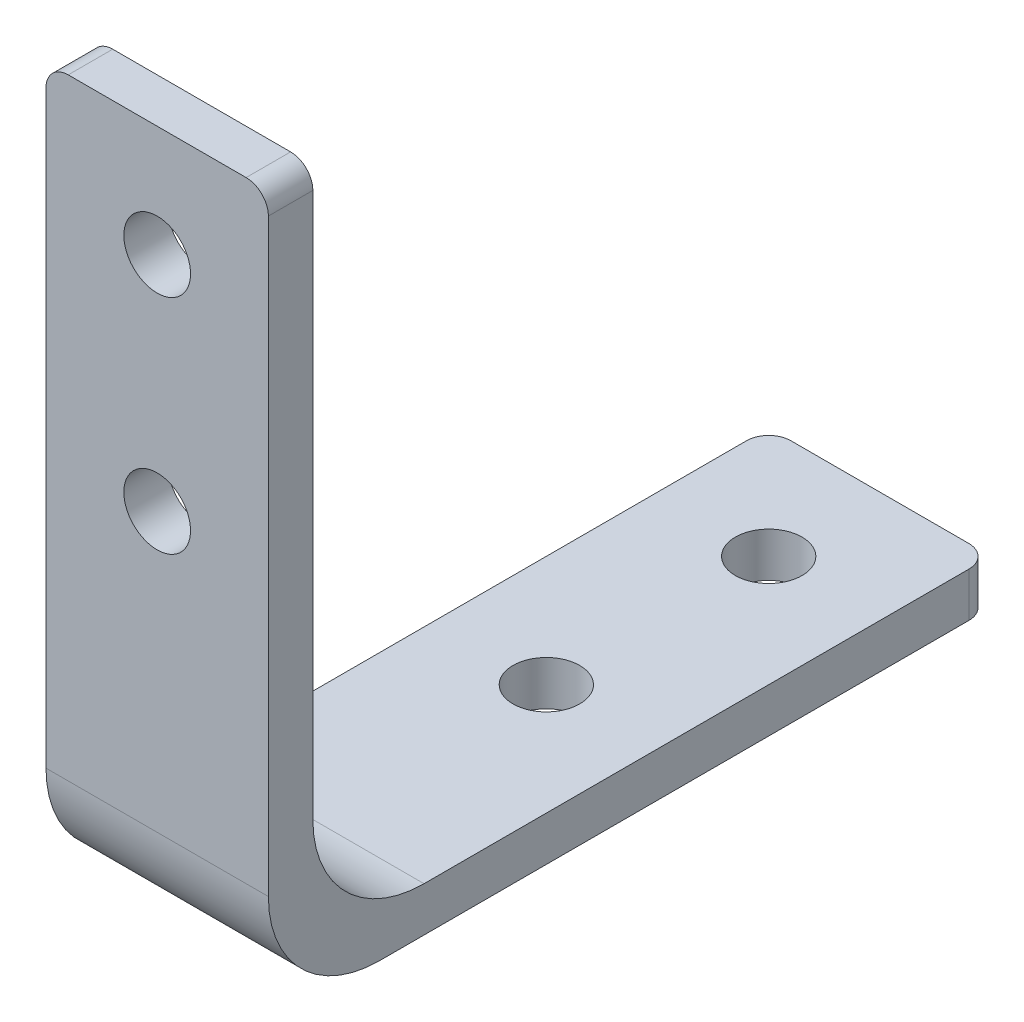
ISO-10303-21;
HEADER;
FILE_DESCRIPTION(('STEP AP214'),'2;1');
FILE_NAME('part.step','',(''),(''),'','','');
FILE_SCHEMA(('AUTOMOTIVE_DESIGN { 1 0 10303 214 1 1 1 1 }'));
ENDSEC;
DATA;
#1=APPLICATION_CONTEXT('core data for automotive mechanical design processes');
#2=APPLICATION_PROTOCOL_DEFINITION('international standard','automotive_design',2000,#1);
#3=PRODUCT_CONTEXT('',#1,'mechanical');
#4=PRODUCT('Part','Part','',(#3));
#5=PRODUCT_RELATED_PRODUCT_CATEGORY('part','',(#4));
#6=PRODUCT_DEFINITION_FORMATION('','',#4);
#7=PRODUCT_DEFINITION_CONTEXT('part definition',#1,'design');
#8=PRODUCT_DEFINITION('design','',#6,#7);
#9=PRODUCT_DEFINITION_SHAPE('','',#8);
#10=(LENGTH_UNIT() NAMED_UNIT(*) SI_UNIT(.MILLI.,.METRE.));
#11=(NAMED_UNIT(*) PLANE_ANGLE_UNIT() SI_UNIT($,.RADIAN.));
#12=(NAMED_UNIT(*) SI_UNIT($,.STERADIAN.) SOLID_ANGLE_UNIT());
#13=UNCERTAINTY_MEASURE_WITH_UNIT(LENGTH_MEASURE(1.E-05),#10,'distance_accuracy_value','');
#14=(GEOMETRIC_REPRESENTATION_CONTEXT(3) GLOBAL_UNCERTAINTY_ASSIGNED_CONTEXT((#13)) GLOBAL_UNIT_ASSIGNED_CONTEXT((#10,
#11,#12)) REPRESENTATION_CONTEXT('',''));
#15=CARTESIAN_POINT('',(0.,0.,0.));
#16=DIRECTION('',(0.,0.,1.));
#17=DIRECTION('',(1.,0.,0.));
#18=AXIS2_PLACEMENT_3D('',#15,#16,#17);
#19=CARTESIAN_POINT('',(-5.,32.5,-2.));
#20=DIRECTION('',(0.,1.,0.));
#21=DIRECTION('',(0.,0.,1.));
#22=AXIS2_PLACEMENT_3D('',#19,#20,#21);
#23=PLANE('',#22);
#24=DIRECTION('',(1.,0.,0.));
#25=VECTOR('',#24,1.);
#26=CARTESIAN_POINT('',(-5.,32.5,0.));
#27=LINE('',#26,#25);
#28=CARTESIAN_POINT('',(-4.,32.5,0.));
#29=VERTEX_POINT('',#28);
#30=CARTESIAN_POINT('',(4.,32.5,0.));
#31=VERTEX_POINT('',#30);
#32=EDGE_CURVE('E151',#29,#31,#27,.T.);
#33=ORIENTED_EDGE('',*,*,#32,.T.);
#34=DIRECTION('',(0.,0.,1.));
#35=VECTOR('',#34,1.);
#36=CARTESIAN_POINT('',(4.,32.5,-2.));
#37=LINE('',#36,#35);
#38=CARTESIAN_POINT('',(4.,32.5,-2.));
#39=VERTEX_POINT('',#38);
#40=EDGE_CURVE('E181',#31,#39,#37,.F.);
#41=ORIENTED_EDGE('',*,*,#40,.T.);
#42=DIRECTION('',(1.,0.,0.));
#43=VECTOR('',#42,1.);
#44=CARTESIAN_POINT('',(-5.,32.5,-2.));
#45=LINE('',#44,#43);
#46=CARTESIAN_POINT('',(-4.,32.5,-2.));
#47=VERTEX_POINT('',#46);
#48=EDGE_CURVE('E147',#47,#39,#45,.T.);
#49=ORIENTED_EDGE('',*,*,#48,.F.);
#50=DIRECTION('',(0.,0.,1.));
#51=VECTOR('',#50,1.);
#52=CARTESIAN_POINT('',(-4.,32.5,0.));
#53=LINE('',#52,#51);
#54=EDGE_CURVE('E178',#47,#29,#53,.T.);
#55=ORIENTED_EDGE('',*,*,#54,.T.);
#56=EDGE_LOOP('',(#33,#41,#49,#55));
#57=FACE_BOUND('',#56,.T.);
#58=ADVANCED_FACE('F34',(#57),#23,.T.);
#59=CARTESIAN_POINT('',(-5.,2.,-2.));
#60=DIRECTION('',(0.,0.,-1.));
#61=DIRECTION('',(0.,1.,0.));
#62=AXIS2_PLACEMENT_3D('',#59,#60,#61);
#63=PLANE('',#62);
#64=CARTESIAN_POINT('',(0.,27.5,-2.));
#65=DIRECTION('',(0.,0.,-1.));
#66=DIRECTION('',(0.,1.,0.));
#67=AXIS2_PLACEMENT_3D('',#64,#65,#66);
#68=CIRCLE('',#67,1.5);
#69=CARTESIAN_POINT('',(0.,29.,-2.));
#70=VERTEX_POINT('',#69);
#71=EDGE_CURVE('E244',#70,#70,#68,.T.);
#72=ORIENTED_EDGE('',*,*,#71,.F.);
#73=EDGE_LOOP('',(#72));
#74=FACE_BOUND('',#73,.T.);
#75=CARTESIAN_POINT('',(0.,17.5,-2.));
#76=DIRECTION('',(0.,0.,-1.));
#77=DIRECTION('',(0.,-1.,0.));
#78=AXIS2_PLACEMENT_3D('',#75,#76,#77);
#79=CIRCLE('',#78,1.5);
#80=CARTESIAN_POINT('',(0.,16.,-2.));
#81=VERTEX_POINT('',#80);
#82=EDGE_CURVE('E238',#81,#81,#79,.T.);
#83=ORIENTED_EDGE('',*,*,#82,.F.);
#84=EDGE_LOOP('',(#83));
#85=FACE_BOUND('',#84,.T.);
#86=DIRECTION('',(0.,1.,0.));
#87=VECTOR('',#86,1.);
#88=CARTESIAN_POINT('',(5.,2.,-2.));
#89=LINE('',#88,#87);
#90=CARTESIAN_POINT('',(5.,7.,-2.));
#91=VERTEX_POINT('',#90);
#92=CARTESIAN_POINT('',(5.,31.5,-2.));
#93=VERTEX_POINT('',#92);
#94=EDGE_CURVE('E204',#91,#93,#89,.T.);
#95=ORIENTED_EDGE('',*,*,#94,.F.);
#96=DIRECTION('',(1.,0.,0.));
#97=VECTOR('',#96,1.);
#98=CARTESIAN_POINT('',(-5.,7.,-2.));
#99=LINE('',#98,#97);
#100=CARTESIAN_POINT('',(-5.,7.,-2.));
#101=VERTEX_POINT('',#100);
#102=EDGE_CURVE('E49',#91,#101,#99,.F.);
#103=ORIENTED_EDGE('',*,*,#102,.T.);
#104=DIRECTION('',(0.,1.,0.));
#105=VECTOR('',#104,1.);
#106=CARTESIAN_POINT('',(-5.,2.,-2.));
#107=LINE('',#106,#105);
#108=CARTESIAN_POINT('',(-5.,31.5,-2.));
#109=VERTEX_POINT('',#108);
#110=EDGE_CURVE('E157',#101,#109,#107,.T.);
#111=ORIENTED_EDGE('',*,*,#110,.T.);
#112=CARTESIAN_POINT('',(-4.,31.5,-2.));
#113=DIRECTION('',(0.,0.,-1.));
#114=DIRECTION('',(0.,1.,0.));
#115=AXIS2_PLACEMENT_3D('',#112,#113,#114);
#116=CIRCLE('',#115,1.);
#117=EDGE_CURVE('E183',#109,#47,#116,.T.);
#118=ORIENTED_EDGE('',*,*,#117,.T.);
#119=ORIENTED_EDGE('',*,*,#48,.T.);
#120=CARTESIAN_POINT('',(4.,31.5,-2.));
#121=DIRECTION('',(0.,0.,-1.));
#122=DIRECTION('',(0.,1.,0.));
#123=AXIS2_PLACEMENT_3D('',#120,#121,#122);
#124=CIRCLE('',#123,1.);
#125=EDGE_CURVE('E185',#39,#93,#124,.T.);
#126=ORIENTED_EDGE('',*,*,#125,.T.);
#127=EDGE_LOOP('',(#95,#103,#111,#118,#119,#126));
#128=FACE_BOUND('',#127,.T.);
#129=ADVANCED_FACE('F208',(#74,#85,#128),#63,.T.);
#130=CARTESIAN_POINT('',(-5.,2.,-32.5));
#131=DIRECTION('',(0.,1.,0.));
#132=DIRECTION('',(0.,0.,1.));
#133=AXIS2_PLACEMENT_3D('',#130,#131,#132);
#134=PLANE('',#133);
#135=CARTESIAN_POINT('',(0.,2.,-27.5));
#136=DIRECTION('',(0.,1.,0.));
#137=DIRECTION('',(0.,0.,1.));
#138=AXIS2_PLACEMENT_3D('',#135,#136,#137);
#139=CIRCLE('',#138,1.5);
#140=CARTESIAN_POINT('',(0.,2.,-26.));
#141=VERTEX_POINT('',#140);
#142=EDGE_CURVE('E233',#141,#141,#139,.T.);
#143=ORIENTED_EDGE('',*,*,#142,.F.);
#144=EDGE_LOOP('',(#143));
#145=FACE_BOUND('',#144,.T.);
#146=CARTESIAN_POINT('',(0.,2.,-17.5));
#147=DIRECTION('',(0.,1.,0.));
#148=DIRECTION('',(0.,0.,-1.));
#149=AXIS2_PLACEMENT_3D('',#146,#147,#148);
#150=CIRCLE('',#149,1.5);
#151=CARTESIAN_POINT('',(0.,2.,-19.));
#152=VERTEX_POINT('',#151);
#153=EDGE_CURVE('E226',#152,#152,#150,.T.);
#154=ORIENTED_EDGE('',*,*,#153,.F.);
#155=EDGE_LOOP('',(#154));
#156=FACE_BOUND('',#155,.T.);
#157=DIRECTION('',(0.,0.,1.));
#158=VECTOR('',#157,1.);
#159=CARTESIAN_POINT('',(-5.,2.,-32.5));
#160=LINE('',#159,#158);
#161=CARTESIAN_POINT('',(-5.,2.,-31.5));
#162=VERTEX_POINT('',#161);
#163=CARTESIAN_POINT('',(-5.,2.,-7.00000000000001));
#164=VERTEX_POINT('',#163);
#165=EDGE_CURVE('E213',#162,#164,#160,.T.);
#166=ORIENTED_EDGE('',*,*,#165,.T.);
#167=DIRECTION('',(1.,0.,0.));
#168=VECTOR('',#167,1.);
#169=CARTESIAN_POINT('',(5.,2.,-7.));
#170=LINE('',#169,#168);
#171=CARTESIAN_POINT('',(5.,2.,-7.00000000000001));
#172=VERTEX_POINT('',#171);
#173=EDGE_CURVE('E197',#164,#172,#170,.T.);
#174=ORIENTED_EDGE('',*,*,#173,.T.);
#175=DIRECTION('',(0.,0.,1.));
#176=VECTOR('',#175,1.);
#177=CARTESIAN_POINT('',(5.,2.,-32.5));
#178=LINE('',#177,#176);
#179=CARTESIAN_POINT('',(5.,2.,-31.5));
#180=VERTEX_POINT('',#179);
#181=EDGE_CURVE('E205',#180,#172,#178,.T.);
#182=ORIENTED_EDGE('',*,*,#181,.F.);
#183=CARTESIAN_POINT('',(4.,2.,-31.5));
#184=DIRECTION('',(0.,1.,0.));
#185=DIRECTION('',(0.,0.,1.));
#186=AXIS2_PLACEMENT_3D('',#183,#184,#185);
#187=CIRCLE('',#186,1.);
#188=CARTESIAN_POINT('',(4.,2.,-32.5));
#189=VERTEX_POINT('',#188);
#190=EDGE_CURVE('E133',#180,#189,#187,.T.);
#191=ORIENTED_EDGE('',*,*,#190,.T.);
#192=DIRECTION('',(1.,0.,0.));
#193=VECTOR('',#192,1.);
#194=CARTESIAN_POINT('',(-5.,2.,-32.5));
#195=LINE('',#194,#193);
#196=CARTESIAN_POINT('',(-4.,2.,-32.5));
#197=VERTEX_POINT('',#196);
#198=EDGE_CURVE('E139',#197,#189,#195,.T.);
#199=ORIENTED_EDGE('',*,*,#198,.F.);
#200=CARTESIAN_POINT('',(-4.,2.,-31.5));
#201=DIRECTION('',(0.,1.,0.));
#202=DIRECTION('',(0.,0.,1.));
#203=AXIS2_PLACEMENT_3D('',#200,#201,#202);
#204=CIRCLE('',#203,1.);
#205=EDGE_CURVE('E123',#197,#162,#204,.T.);
#206=ORIENTED_EDGE('',*,*,#205,.T.);
#207=EDGE_LOOP('',(#166,#174,#182,#191,#199,#206));
#208=FACE_BOUND('',#207,.T.);
#209=ADVANCED_FACE('F145',(#145,#156,#208),#134,.T.);
#210=CARTESIAN_POINT('',(-5.,0.,-32.5));
#211=DIRECTION('',(0.,0.,-1.));
#212=DIRECTION('',(-1.,0.,0.));
#213=AXIS2_PLACEMENT_3D('',#210,#211,#212);
#214=PLANE('',#213);
#215=DIRECTION('',(1.,0.,0.));
#216=VECTOR('',#215,1.);
#217=CARTESIAN_POINT('',(-5.,0.,-32.5));
#218=LINE('',#217,#216);
#219=CARTESIAN_POINT('',(-4.,0.,-32.5));
#220=VERTEX_POINT('',#219);
#221=CARTESIAN_POINT('',(4.,0.,-32.5));
#222=VERTEX_POINT('',#221);
#223=EDGE_CURVE('E142',#220,#222,#218,.T.);
#224=ORIENTED_EDGE('',*,*,#223,.F.);
#225=DIRECTION('',(0.,1.,0.));
#226=VECTOR('',#225,1.);
#227=CARTESIAN_POINT('',(-4.,2.,-32.5));
#228=LINE('',#227,#226);
#229=EDGE_CURVE('E127',#220,#197,#228,.T.);
#230=ORIENTED_EDGE('',*,*,#229,.T.);
#231=ORIENTED_EDGE('',*,*,#198,.T.);
#232=DIRECTION('',(0.,1.,0.));
#233=VECTOR('',#232,1.);
#234=CARTESIAN_POINT('',(4.,0.,-32.5));
#235=LINE('',#234,#233);
#236=EDGE_CURVE('E143',#189,#222,#235,.F.);
#237=ORIENTED_EDGE('',*,*,#236,.T.);
#238=EDGE_LOOP('',(#224,#230,#231,#237));
#239=FACE_BOUND('',#238,.T.);
#240=ADVANCED_FACE('F138',(#239),#214,.T.);
#241=CARTESIAN_POINT('',(-5.,0.,0.));
#242=DIRECTION('',(0.,-1.,0.));
#243=DIRECTION('',(0.,0.,-1.));
#244=AXIS2_PLACEMENT_3D('',#241,#242,#243);
#245=PLANE('',#244);
#246=CARTESIAN_POINT('',(0.,0.,-27.5));
#247=DIRECTION('',(0.,1.,0.));
#248=DIRECTION('',(0.,0.,1.));
#249=AXIS2_PLACEMENT_3D('',#246,#247,#248);
#250=CIRCLE('',#249,1.5);
#251=CARTESIAN_POINT('',(0.,0.,-26.));
#252=VERTEX_POINT('',#251);
#253=EDGE_CURVE('E225',#252,#252,#250,.T.);
#254=ORIENTED_EDGE('',*,*,#253,.T.);
#255=EDGE_LOOP('',(#254));
#256=FACE_BOUND('',#255,.T.);
#257=CARTESIAN_POINT('',(0.,0.,-17.5));
#258=DIRECTION('',(0.,1.,0.));
#259=DIRECTION('',(0.,0.,-1.));
#260=AXIS2_PLACEMENT_3D('',#257,#258,#259);
#261=CIRCLE('',#260,1.5);
#262=CARTESIAN_POINT('',(0.,0.,-19.));
#263=VERTEX_POINT('',#262);
#264=EDGE_CURVE('E229',#263,#263,#261,.T.);
#265=ORIENTED_EDGE('',*,*,#264,.T.);
#266=EDGE_LOOP('',(#265));
#267=FACE_BOUND('',#266,.T.);
#268=DIRECTION('',(0.,0.,-1.));
#269=VECTOR('',#268,1.);
#270=CARTESIAN_POINT('',(5.,0.,0.));
#271=LINE('',#270,#269);
#272=CARTESIAN_POINT('',(5.,0.,-5.));
#273=VERTEX_POINT('',#272);
#274=CARTESIAN_POINT('',(5.,0.,-31.5));
#275=VERTEX_POINT('',#274);
#276=EDGE_CURVE('E221',#273,#275,#271,.T.);
#277=ORIENTED_EDGE('',*,*,#276,.F.);
#278=DIRECTION('',(1.,0.,0.));
#279=VECTOR('',#278,1.);
#280=CARTESIAN_POINT('',(-5.,0.,-5.));
#281=LINE('',#280,#279);
#282=CARTESIAN_POINT('',(-5.,0.,-5.));
#283=VERTEX_POINT('',#282);
#284=EDGE_CURVE('E193',#273,#283,#281,.F.);
#285=ORIENTED_EDGE('',*,*,#284,.T.);
#286=DIRECTION('',(0.,0.,-1.));
#287=VECTOR('',#286,1.);
#288=CARTESIAN_POINT('',(-5.,0.,0.));
#289=LINE('',#288,#287);
#290=CARTESIAN_POINT('',(-5.,0.,-31.5));
#291=VERTEX_POINT('',#290);
#292=EDGE_CURVE('E214',#283,#291,#289,.T.);
#293=ORIENTED_EDGE('',*,*,#292,.T.);
#294=CARTESIAN_POINT('',(-4.,0.,-31.5));
#295=DIRECTION('',(0.,-1.,0.));
#296=DIRECTION('',(0.,0.,-1.));
#297=AXIS2_PLACEMENT_3D('',#294,#295,#296);
#298=CIRCLE('',#297,1.);
#299=EDGE_CURVE('E166',#291,#220,#298,.T.);
#300=ORIENTED_EDGE('',*,*,#299,.T.);
#301=ORIENTED_EDGE('',*,*,#223,.T.);
#302=CARTESIAN_POINT('',(4.,0.,-31.5));
#303=DIRECTION('',(0.,-1.,0.));
#304=DIRECTION('',(0.,0.,-1.));
#305=AXIS2_PLACEMENT_3D('',#302,#303,#304);
#306=CIRCLE('',#305,1.);
#307=EDGE_CURVE('E163',#222,#275,#306,.T.);
#308=ORIENTED_EDGE('',*,*,#307,.T.);
#309=EDGE_LOOP('',(#277,#285,#293,#300,#301,#308));
#310=FACE_BOUND('',#309,.T.);
#311=ADVANCED_FACE('F319',(#256,#267,#310),#245,.T.);
#312=CARTESIAN_POINT('',(-5.,32.5,0.));
#313=DIRECTION('',(0.,0.,1.));
#314=DIRECTION('',(1.,0.,0.));
#315=AXIS2_PLACEMENT_3D('',#312,#313,#314);
#316=PLANE('',#315);
#317=CARTESIAN_POINT('',(0.,27.5,0.));
#318=DIRECTION('',(0.,0.,-1.));
#319=DIRECTION('',(0.,1.,0.));
#320=AXIS2_PLACEMENT_3D('',#317,#318,#319);
#321=CIRCLE('',#320,1.5);
#322=CARTESIAN_POINT('',(0.,29.,0.));
#323=VERTEX_POINT('',#322);
#324=EDGE_CURVE('E230',#323,#323,#321,.T.);
#325=ORIENTED_EDGE('',*,*,#324,.T.);
#326=EDGE_LOOP('',(#325));
#327=FACE_BOUND('',#326,.T.);
#328=CARTESIAN_POINT('',(0.,17.5,0.));
#329=DIRECTION('',(0.,0.,-1.));
#330=DIRECTION('',(0.,-1.,0.));
#331=AXIS2_PLACEMENT_3D('',#328,#329,#330);
#332=CIRCLE('',#331,1.5);
#333=CARTESIAN_POINT('',(0.,16.,0.));
#334=VERTEX_POINT('',#333);
#335=EDGE_CURVE('E241',#334,#334,#332,.T.);
#336=ORIENTED_EDGE('',*,*,#335,.T.);
#337=EDGE_LOOP('',(#336));
#338=FACE_BOUND('',#337,.T.);
#339=DIRECTION('',(0.,-1.,0.));
#340=VECTOR('',#339,1.);
#341=CARTESIAN_POINT('',(-5.,32.5,0.));
#342=LINE('',#341,#340);
#343=CARTESIAN_POINT('',(-5.,31.5,0.));
#344=VERTEX_POINT('',#343);
#345=CARTESIAN_POINT('',(-5.,5.,0.));
#346=VERTEX_POINT('',#345);
#347=EDGE_CURVE('E211',#344,#346,#342,.T.);
#348=ORIENTED_EDGE('',*,*,#347,.T.);
#349=DIRECTION('',(1.,0.,0.));
#350=VECTOR('',#349,1.);
#351=CARTESIAN_POINT('',(-5.,5.,0.));
#352=LINE('',#351,#350);
#353=CARTESIAN_POINT('',(5.,5.,0.));
#354=VERTEX_POINT('',#353);
#355=EDGE_CURVE('E188',#346,#354,#352,.T.);
#356=ORIENTED_EDGE('',*,*,#355,.T.);
#357=DIRECTION('',(0.,-1.,0.));
#358=VECTOR('',#357,1.);
#359=CARTESIAN_POINT('',(5.,32.5,0.));
#360=LINE('',#359,#358);
#361=CARTESIAN_POINT('',(5.,31.5,0.));
#362=VERTEX_POINT('',#361);
#363=EDGE_CURVE('E223',#362,#354,#360,.T.);
#364=ORIENTED_EDGE('',*,*,#363,.F.);
#365=CARTESIAN_POINT('',(4.,31.5,0.));
#366=DIRECTION('',(0.,0.,1.));
#367=DIRECTION('',(1.,0.,0.));
#368=AXIS2_PLACEMENT_3D('',#365,#366,#367);
#369=CIRCLE('',#368,1.);
#370=EDGE_CURVE('E176',#362,#31,#369,.T.);
#371=ORIENTED_EDGE('',*,*,#370,.T.);
#372=ORIENTED_EDGE('',*,*,#32,.F.);
#373=CARTESIAN_POINT('',(-4.,31.5,0.));
#374=DIRECTION('',(0.,0.,1.));
#375=DIRECTION('',(1.,0.,0.));
#376=AXIS2_PLACEMENT_3D('',#373,#374,#375);
#377=CIRCLE('',#376,1.);
#378=EDGE_CURVE('E174',#29,#344,#377,.T.);
#379=ORIENTED_EDGE('',*,*,#378,.T.);
#380=EDGE_LOOP('',(#348,#356,#364,#371,#372,#379));
#381=FACE_BOUND('',#380,.T.);
#382=ADVANCED_FACE('F250',(#327,#338,#381),#316,.T.);
#383=CARTESIAN_POINT('',(-5.,0.,0.));
#384=DIRECTION('',(1.,0.,0.));
#385=DIRECTION('',(0.,0.,-1.));
#386=AXIS2_PLACEMENT_3D('',#383,#384,#385);
#387=PLANE('',#386);
#388=ORIENTED_EDGE('',*,*,#292,.F.);
#389=CARTESIAN_POINT('',(-5.,5.,-5.));
#390=DIRECTION('',(1.,0.,0.));
#391=DIRECTION('',(0.,0.,-1.));
#392=AXIS2_PLACEMENT_3D('',#389,#390,#391);
#393=CIRCLE('',#392,5.);
#394=EDGE_CURVE('E195',#283,#346,#393,.F.);
#395=ORIENTED_EDGE('',*,*,#394,.T.);
#396=ORIENTED_EDGE('',*,*,#347,.F.);
#397=DIRECTION('',(0.,0.,1.));
#398=VECTOR('',#397,1.);
#399=CARTESIAN_POINT('',(-5.,31.5,-2.));
#400=LINE('',#399,#398);
#401=EDGE_CURVE('E132',#344,#109,#400,.F.);
#402=ORIENTED_EDGE('',*,*,#401,.T.);
#403=ORIENTED_EDGE('',*,*,#110,.F.);
#404=CARTESIAN_POINT('',(-5.,7.,-7.));
#405=DIRECTION('',(1.,0.,0.));
#406=DIRECTION('',(0.,0.,-1.));
#407=AXIS2_PLACEMENT_3D('',#404,#405,#406);
#408=CIRCLE('',#407,5.);
#409=EDGE_CURVE('E11',#101,#164,#408,.T.);
#410=ORIENTED_EDGE('',*,*,#409,.T.);
#411=ORIENTED_EDGE('',*,*,#165,.F.);
#412=DIRECTION('',(0.,1.,0.));
#413=VECTOR('',#412,1.);
#414=CARTESIAN_POINT('',(-5.,0.,-31.5));
#415=LINE('',#414,#413);
#416=EDGE_CURVE('E129',#162,#291,#415,.F.);
#417=ORIENTED_EDGE('',*,*,#416,.T.);
#418=EDGE_LOOP('',(#388,#395,#396,#402,#403,#410,#411,#417));
#419=FACE_BOUND('',#418,.T.);
#420=ADVANCED_FACE('F308',(#419),#387,.F.);
#421=CARTESIAN_POINT('',(5.,0.,0.));
#422=DIRECTION('',(1.,0.,0.));
#423=DIRECTION('',(0.,0.,-1.));
#424=AXIS2_PLACEMENT_3D('',#421,#422,#423);
#425=PLANE('',#424);
#426=ORIENTED_EDGE('',*,*,#363,.T.);
#427=CARTESIAN_POINT('',(5.,5.,-5.));
#428=DIRECTION('',(1.,0.,0.));
#429=DIRECTION('',(0.,0.,-1.));
#430=AXIS2_PLACEMENT_3D('',#427,#428,#429);
#431=CIRCLE('',#430,5.);
#432=EDGE_CURVE('E191',#354,#273,#431,.T.);
#433=ORIENTED_EDGE('',*,*,#432,.T.);
#434=ORIENTED_EDGE('',*,*,#276,.T.);
#435=DIRECTION('',(0.,1.,0.));
#436=VECTOR('',#435,1.);
#437=CARTESIAN_POINT('',(5.,0.,-31.5));
#438=LINE('',#437,#436);
#439=EDGE_CURVE('E171',#275,#180,#438,.T.);
#440=ORIENTED_EDGE('',*,*,#439,.T.);
#441=ORIENTED_EDGE('',*,*,#181,.T.);
#442=CARTESIAN_POINT('',(5.,7.,-7.));
#443=DIRECTION('',(1.,0.,0.));
#444=DIRECTION('',(0.,0.,-1.));
#445=AXIS2_PLACEMENT_3D('',#442,#443,#444);
#446=CIRCLE('',#445,5.);
#447=EDGE_CURVE('E42',#172,#91,#446,.F.);
#448=ORIENTED_EDGE('',*,*,#447,.T.);
#449=ORIENTED_EDGE('',*,*,#94,.T.);
#450=DIRECTION('',(0.,0.,1.));
#451=VECTOR('',#450,1.);
#452=CARTESIAN_POINT('',(5.,31.5,0.));
#453=LINE('',#452,#451);
#454=EDGE_CURVE('E168',#93,#362,#453,.T.);
#455=ORIENTED_EDGE('',*,*,#454,.T.);
#456=EDGE_LOOP('',(#426,#433,#434,#440,#441,#448,#449,#455));
#457=FACE_BOUND('',#456,.T.);
#458=ADVANCED_FACE('F203',(#457),#425,.T.);
#459=CARTESIAN_POINT('',(0.,0.,-17.5));
#460=DIRECTION('',(0.,1.,0.));
#461=DIRECTION('',(0.,0.,1.));
#462=AXIS2_PLACEMENT_3D('',#459,#460,#461);
#463=CYLINDRICAL_SURFACE('',#462,1.5);
#464=ORIENTED_EDGE('',*,*,#264,.F.);
#465=EDGE_LOOP('',(#464));
#466=FACE_BOUND('',#465,.T.);
#467=ORIENTED_EDGE('',*,*,#153,.T.);
#468=EDGE_LOOP('',(#467));
#469=FACE_BOUND('',#468,.T.);
#470=ADVANCED_FACE('F272',(#466,#469),#463,.F.);
#471=CARTESIAN_POINT('',(0.,0.,-27.5));
#472=DIRECTION('',(0.,1.,0.));
#473=DIRECTION('',(0.,0.,1.));
#474=AXIS2_PLACEMENT_3D('',#471,#472,#473);
#475=CYLINDRICAL_SURFACE('',#474,1.5);
#476=ORIENTED_EDGE('',*,*,#253,.F.);
#477=EDGE_LOOP('',(#476));
#478=FACE_BOUND('',#477,.T.);
#479=ORIENTED_EDGE('',*,*,#142,.T.);
#480=EDGE_LOOP('',(#479));
#481=FACE_BOUND('',#480,.T.);
#482=ADVANCED_FACE('F266',(#478,#481),#475,.F.);
#483=CARTESIAN_POINT('',(0.,17.5,0.));
#484=DIRECTION('',(0.,0.,-1.));
#485=DIRECTION('',(0.,1.,0.));
#486=AXIS2_PLACEMENT_3D('',#483,#484,#485);
#487=CYLINDRICAL_SURFACE('',#486,1.5);
#488=ORIENTED_EDGE('',*,*,#335,.F.);
#489=EDGE_LOOP('',(#488));
#490=FACE_BOUND('',#489,.T.);
#491=ORIENTED_EDGE('',*,*,#82,.T.);
#492=EDGE_LOOP('',(#491));
#493=FACE_BOUND('',#492,.T.);
#494=ADVANCED_FACE('F256',(#490,#493),#487,.F.);
#495=CARTESIAN_POINT('',(0.,27.5,0.));
#496=DIRECTION('',(0.,0.,-1.));
#497=DIRECTION('',(0.,1.,0.));
#498=AXIS2_PLACEMENT_3D('',#495,#496,#497);
#499=CYLINDRICAL_SURFACE('',#498,1.5);
#500=ORIENTED_EDGE('',*,*,#324,.F.);
#501=EDGE_LOOP('',(#500));
#502=FACE_BOUND('',#501,.T.);
#503=ORIENTED_EDGE('',*,*,#71,.T.);
#504=EDGE_LOOP('',(#503));
#505=FACE_BOUND('',#504,.T.);
#506=ADVANCED_FACE('F253',(#502,#505),#499,.F.);
#507=CARTESIAN_POINT('',(-4.,0.,-31.5));
#508=DIRECTION('',(0.,-1.,0.));
#509=DIRECTION('',(0.,0.,-1.));
#510=AXIS2_PLACEMENT_3D('',#507,#508,#509);
#511=CYLINDRICAL_SURFACE('',#510,1.);
#512=ORIENTED_EDGE('',*,*,#299,.F.);
#513=ORIENTED_EDGE('',*,*,#416,.F.);
#514=ORIENTED_EDGE('',*,*,#205,.F.);
#515=ORIENTED_EDGE('',*,*,#229,.F.);
#516=EDGE_LOOP('',(#512,#513,#514,#515));
#517=FACE_BOUND('',#516,.T.);
#518=ADVANCED_FACE('F126',(#517),#511,.T.);
#519=CARTESIAN_POINT('',(4.,0.,-31.5));
#520=DIRECTION('',(0.,1.,0.));
#521=DIRECTION('',(0.,0.,1.));
#522=AXIS2_PLACEMENT_3D('',#519,#520,#521);
#523=CYLINDRICAL_SURFACE('',#522,1.);
#524=ORIENTED_EDGE('',*,*,#307,.F.);
#525=ORIENTED_EDGE('',*,*,#236,.F.);
#526=ORIENTED_EDGE('',*,*,#190,.F.);
#527=ORIENTED_EDGE('',*,*,#439,.F.);
#528=EDGE_LOOP('',(#524,#525,#526,#527));
#529=FACE_BOUND('',#528,.T.);
#530=ADVANCED_FACE('F286',(#529),#523,.T.);
#531=CARTESIAN_POINT('',(4.,31.5,0.));
#532=DIRECTION('',(0.,0.,1.));
#533=DIRECTION('',(1.,0.,0.));
#534=AXIS2_PLACEMENT_3D('',#531,#532,#533);
#535=CYLINDRICAL_SURFACE('',#534,1.);
#536=ORIENTED_EDGE('',*,*,#125,.F.);
#537=ORIENTED_EDGE('',*,*,#40,.F.);
#538=ORIENTED_EDGE('',*,*,#370,.F.);
#539=ORIENTED_EDGE('',*,*,#454,.F.);
#540=EDGE_LOOP('',(#536,#537,#538,#539));
#541=FACE_BOUND('',#540,.T.);
#542=ADVANCED_FACE('F289',(#541),#535,.T.);
#543=CARTESIAN_POINT('',(-4.,31.5,-2.));
#544=DIRECTION('',(0.,0.,-1.));
#545=DIRECTION('',(-1.,0.,0.));
#546=AXIS2_PLACEMENT_3D('',#543,#544,#545);
#547=CYLINDRICAL_SURFACE('',#546,1.);
#548=ORIENTED_EDGE('',*,*,#117,.F.);
#549=ORIENTED_EDGE('',*,*,#401,.F.);
#550=ORIENTED_EDGE('',*,*,#378,.F.);
#551=ORIENTED_EDGE('',*,*,#54,.F.);
#552=EDGE_LOOP('',(#548,#549,#550,#551));
#553=FACE_BOUND('',#552,.T.);
#554=ADVANCED_FACE('F293',(#553),#547,.T.);
#555=CARTESIAN_POINT('',(-5.,5.,-5.));
#556=DIRECTION('',(1.,0.,0.));
#557=DIRECTION('',(0.,0.,-1.));
#558=AXIS2_PLACEMENT_3D('',#555,#556,#557);
#559=CYLINDRICAL_SURFACE('',#558,5.);
#560=ORIENTED_EDGE('',*,*,#394,.F.);
#561=ORIENTED_EDGE('',*,*,#284,.F.);
#562=ORIENTED_EDGE('',*,*,#432,.F.);
#563=ORIENTED_EDGE('',*,*,#355,.F.);
#564=EDGE_LOOP('',(#560,#561,#562,#563));
#565=FACE_BOUND('',#564,.T.);
#566=ADVANCED_FACE('F296',(#565),#559,.T.);
#567=CARTESIAN_POINT('',(-5.,7.,-7.));
#568=DIRECTION('',(-1.,0.,0.));
#569=DIRECTION('',(0.,0.,1.));
#570=AXIS2_PLACEMENT_3D('',#567,#568,#569);
#571=CYLINDRICAL_SURFACE('',#570,5.);
#572=ORIENTED_EDGE('',*,*,#409,.F.);
#573=ORIENTED_EDGE('',*,*,#102,.F.);
#574=ORIENTED_EDGE('',*,*,#447,.F.);
#575=ORIENTED_EDGE('',*,*,#173,.F.);
#576=EDGE_LOOP('',(#572,#573,#574,#575));
#577=FACE_BOUND('',#576,.T.);
#578=ADVANCED_FACE('F36',(#577),#571,.F.);
#579=CLOSED_SHELL('',(#58,#129,#209,#240,#311,#382,#420,#458,#470,#482,#494,#506,#518,#530,#542,
#554,#566,#578));
#580=MANIFOLD_SOLID_BREP('B2',#579);
#581=ADVANCED_BREP_SHAPE_REPRESENTATION('',(#18,#580),#14);
#582=SHAPE_DEFINITION_REPRESENTATION(#9,#581);
ENDSEC;
END-ISO-10303-21;
